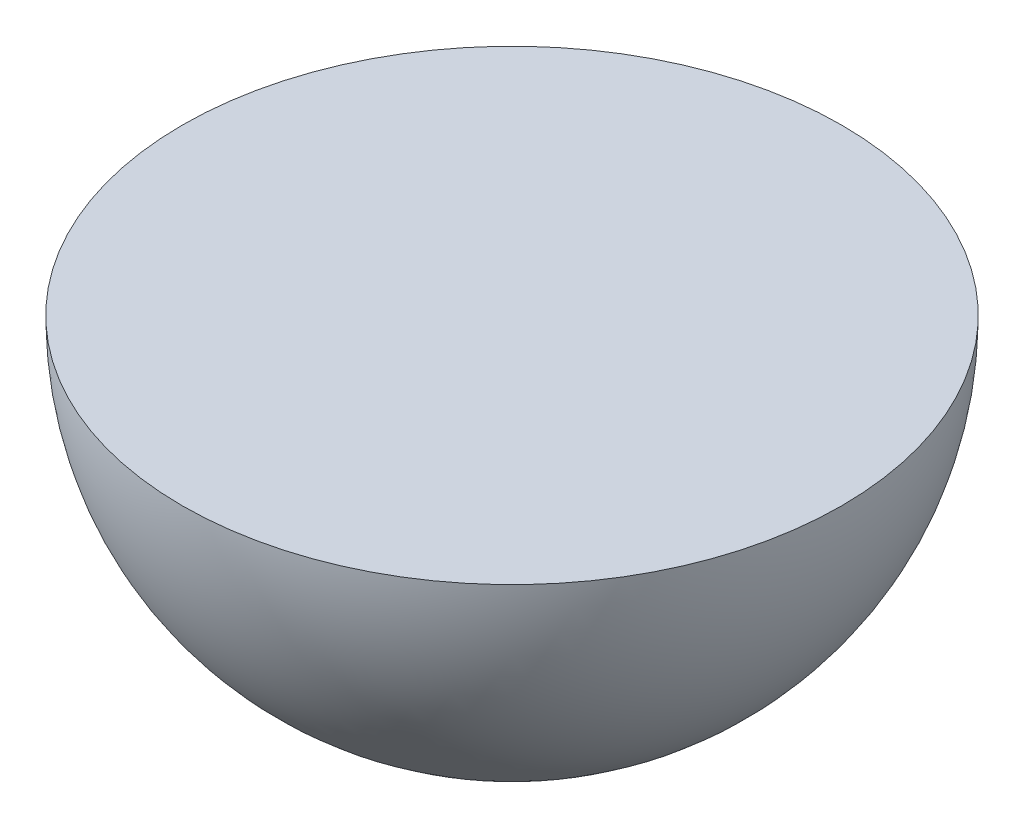
ISO-10303-21;
HEADER;
FILE_DESCRIPTION(('STEP AP214'),'2;1');
FILE_NAME('part.step','',(''),(''),'','','');
FILE_SCHEMA(('AUTOMOTIVE_DESIGN { 1 0 10303 214 1 1 1 1 }'));
ENDSEC;
DATA;
#1=APPLICATION_CONTEXT('core data for automotive mechanical design processes');
#2=APPLICATION_PROTOCOL_DEFINITION('international standard','automotive_design',2000,#1);
#3=PRODUCT_CONTEXT('',#1,'mechanical');
#4=PRODUCT('Part','Part','',(#3));
#5=PRODUCT_RELATED_PRODUCT_CATEGORY('part','',(#4));
#6=PRODUCT_DEFINITION_FORMATION('','',#4);
#7=PRODUCT_DEFINITION_CONTEXT('part definition',#1,'design');
#8=PRODUCT_DEFINITION('design','',#6,#7);
#9=PRODUCT_DEFINITION_SHAPE('','',#8);
#10=(LENGTH_UNIT() NAMED_UNIT(*) SI_UNIT(.MILLI.,.METRE.));
#11=(NAMED_UNIT(*) PLANE_ANGLE_UNIT() SI_UNIT($,.RADIAN.));
#12=(NAMED_UNIT(*) SI_UNIT($,.STERADIAN.) SOLID_ANGLE_UNIT());
#13=UNCERTAINTY_MEASURE_WITH_UNIT(LENGTH_MEASURE(1.E-05),#10,'distance_accuracy_value','');
#14=(GEOMETRIC_REPRESENTATION_CONTEXT(3) GLOBAL_UNCERTAINTY_ASSIGNED_CONTEXT((#13)) GLOBAL_UNIT_ASSIGNED_CONTEXT((#10,
#11,#12)) REPRESENTATION_CONTEXT('',''));
#15=CARTESIAN_POINT('',(0.,0.,0.));
#16=DIRECTION('',(0.,0.,1.));
#17=DIRECTION('',(1.,0.,0.));
#18=AXIS2_PLACEMENT_3D('',#15,#16,#17);
#19=CARTESIAN_POINT('',(0.,-30.,0.));
#20=DIRECTION('',(0.,-1.,0.));
#21=DIRECTION('',(-1.,0.,0.));
#22=AXIS2_PLACEMENT_3D('',#19,#20,#21);
#23=SPHERICAL_SURFACE('',#22,9.525);
#24=CARTESIAN_POINT('',(0.,-30.,0.));
#25=DIRECTION('',(0.,-1.,0.));
#26=DIRECTION('',(1.,0.,0.));
#27=AXIS2_PLACEMENT_3D('',#24,#25,#26);
#28=CIRCLE('',#27,9.52499999999999);
#29=CARTESIAN_POINT('',(9.525,-30.,0.));
#30=VERTEX_POINT('',#29);
#31=EDGE_CURVE('E11',#30,#30,#28,.T.);
#32=ORIENTED_EDGE('',*,*,#31,.T.);
#33=EDGE_LOOP('',(#32));
#34=FACE_BOUND('',#33,.T.);
#35=ADVANCED_FACE('F39',(#34),#23,.T.);
#36=CARTESIAN_POINT('',(0.,-30.,0.));
#37=DIRECTION('',(0.,1.,0.));
#38=DIRECTION('',(-1.,0.,0.));
#39=AXIS2_PLACEMENT_3D('',#36,#37,#38);
#40=PLANE('',#39);
#41=ORIENTED_EDGE('',*,*,#31,.F.);
#42=EDGE_LOOP('',(#41));
#43=FACE_BOUND('',#42,.T.);
#44=ADVANCED_FACE('F47',(#43),#40,.T.);
#45=CLOSED_SHELL('',(#35,#44));
#46=MANIFOLD_SOLID_BREP('B2',#45);
#47=ADVANCED_BREP_SHAPE_REPRESENTATION('',(#18,#46),#14);
#48=SHAPE_DEFINITION_REPRESENTATION(#9,#47);
ENDSEC;
END-ISO-10303-21;
